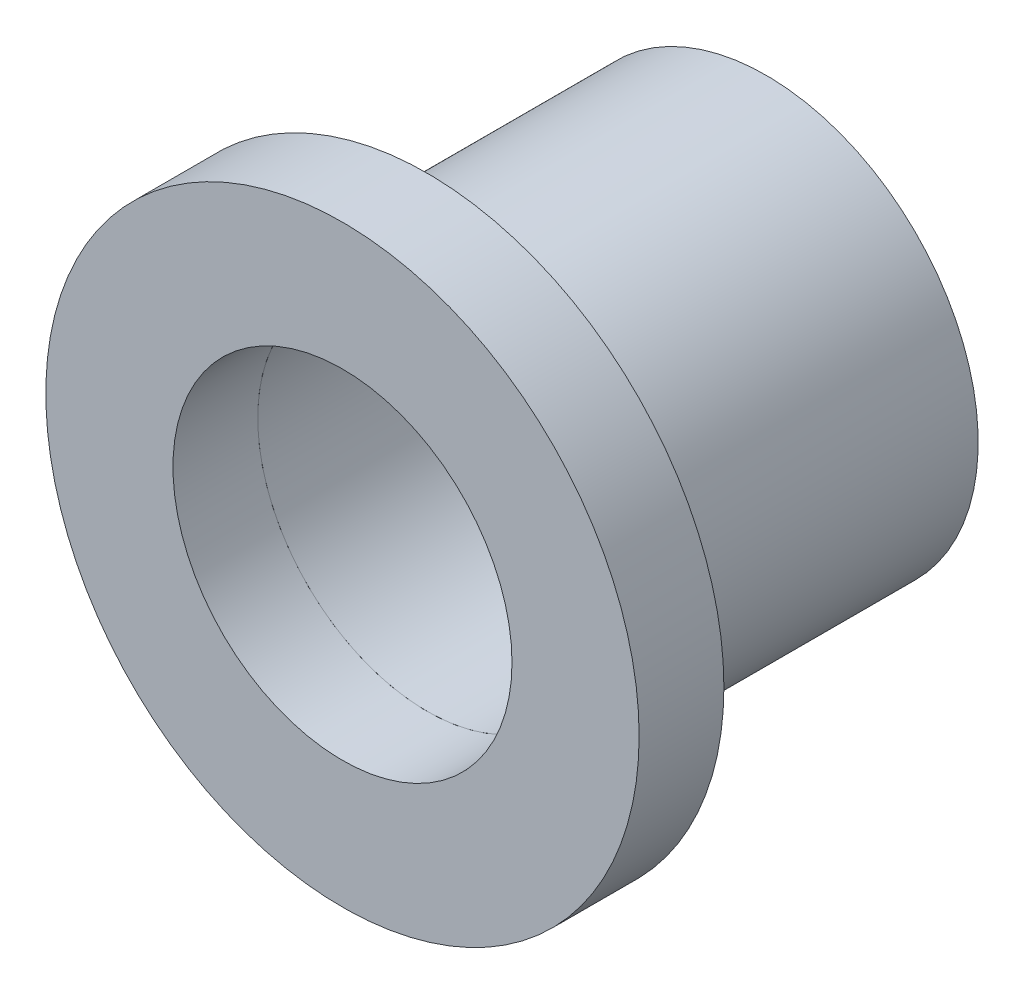
ISO-10303-21;
HEADER;
FILE_DESCRIPTION(('STEP AP214'),'2;1');
FILE_NAME('part.step','',(''),(''),'','','');
FILE_SCHEMA(('AUTOMOTIVE_DESIGN { 1 0 10303 214 1 1 1 1 }'));
ENDSEC;
DATA;
#1=APPLICATION_CONTEXT('core data for automotive mechanical design processes');
#2=APPLICATION_PROTOCOL_DEFINITION('international standard','automotive_design',2000,#1);
#3=PRODUCT_CONTEXT('',#1,'mechanical');
#4=PRODUCT('Part','Part','',(#3));
#5=PRODUCT_RELATED_PRODUCT_CATEGORY('part','',(#4));
#6=PRODUCT_DEFINITION_FORMATION('','',#4);
#7=PRODUCT_DEFINITION_CONTEXT('part definition',#1,'design');
#8=PRODUCT_DEFINITION('design','',#6,#7);
#9=PRODUCT_DEFINITION_SHAPE('','',#8);
#10=(LENGTH_UNIT() NAMED_UNIT(*) SI_UNIT(.MILLI.,.METRE.));
#11=(NAMED_UNIT(*) PLANE_ANGLE_UNIT() SI_UNIT($,.RADIAN.));
#12=(NAMED_UNIT(*) SI_UNIT($,.STERADIAN.) SOLID_ANGLE_UNIT());
#13=UNCERTAINTY_MEASURE_WITH_UNIT(LENGTH_MEASURE(1.E-05),#10,'distance_accuracy_value','');
#14=(GEOMETRIC_REPRESENTATION_CONTEXT(3) GLOBAL_UNCERTAINTY_ASSIGNED_CONTEXT((#13)) GLOBAL_UNIT_ASSIGNED_CONTEXT((#10,
#11,#12)) REPRESENTATION_CONTEXT('',''));
#15=CARTESIAN_POINT('',(0.,0.,0.));
#16=DIRECTION('',(0.,0.,1.));
#17=DIRECTION('',(1.,0.,0.));
#18=AXIS2_PLACEMENT_3D('',#15,#16,#17);
#19=CARTESIAN_POINT('',(0.,0.,-12.7));
#20=DIRECTION('',(0.,0.,-1.));
#21=DIRECTION('',(-1.,0.,0.));
#22=AXIS2_PLACEMENT_3D('',#19,#20,#21);
#23=PLANE('',#22);
#24=CARTESIAN_POINT('',(0.,0.,-12.7));
#25=DIRECTION('',(0.,0.,-1.));
#26=DIRECTION('',(-1.,0.,0.));
#27=AXIS2_PLACEMENT_3D('',#24,#25,#26);
#28=CIRCLE('',#27,7.9375);
#29=CARTESIAN_POINT('',(-7.9375,0.,-12.7));
#30=VERTEX_POINT('',#29);
#31=EDGE_CURVE('E11',#30,#30,#28,.T.);
#32=ORIENTED_EDGE('',*,*,#31,.T.);
#33=EDGE_LOOP('',(#32));
#34=FACE_BOUND('',#33,.T.);
#35=CARTESIAN_POINT('',(0.,0.,-12.7));
#36=DIRECTION('',(0.,0.,-1.));
#37=DIRECTION('',(-1.,0.,0.));
#38=AXIS2_PLACEMENT_3D('',#35,#36,#37);
#39=CIRCLE('',#38,6.35);
#40=CARTESIAN_POINT('',(-6.35,0.,-12.7));
#41=VERTEX_POINT('',#40);
#42=EDGE_CURVE('E51',#41,#41,#39,.T.);
#43=ORIENTED_EDGE('',*,*,#42,.F.);
#44=EDGE_LOOP('',(#43));
#45=FACE_BOUND('',#44,.T.);
#46=ADVANCED_FACE('F40',(#34,#45),#23,.T.);
#47=CARTESIAN_POINT('',(0.,0.,0.));
#48=DIRECTION('',(0.,0.,-1.));
#49=DIRECTION('',(-1.,0.,0.));
#50=AXIS2_PLACEMENT_3D('',#47,#48,#49);
#51=PLANE('',#50);
#52=CARTESIAN_POINT('',(0.,0.,0.));
#53=DIRECTION('',(0.,0.,-1.));
#54=DIRECTION('',(-1.,0.,0.));
#55=AXIS2_PLACEMENT_3D('',#52,#53,#54);
#56=CIRCLE('',#55,7.9375);
#57=CARTESIAN_POINT('',(-7.9375,0.,0.));
#58=VERTEX_POINT('',#57);
#59=EDGE_CURVE('E44',#58,#58,#56,.T.);
#60=ORIENTED_EDGE('',*,*,#59,.F.);
#61=EDGE_LOOP('',(#60));
#62=FACE_BOUND('',#61,.T.);
#63=CARTESIAN_POINT('',(0.,0.,0.));
#64=DIRECTION('',(0.,0.,-1.));
#65=DIRECTION('',(-1.,0.,0.));
#66=AXIS2_PLACEMENT_3D('',#63,#64,#65);
#67=CIRCLE('',#66,6.35);
#68=CARTESIAN_POINT('',(-6.35,0.,0.));
#69=VERTEX_POINT('',#68);
#70=EDGE_CURVE('E53',#69,#69,#67,.T.);
#71=ORIENTED_EDGE('',*,*,#70,.T.);
#72=EDGE_LOOP('',(#71));
#73=FACE_BOUND('',#72,.T.);
#74=ADVANCED_FACE('F63',(#62,#73),#51,.F.);
#75=CARTESIAN_POINT('',(0.,0.,-12.7));
#76=DIRECTION('',(0.,0.,1.));
#77=DIRECTION('',(1.,0.,0.));
#78=AXIS2_PLACEMENT_3D('',#75,#76,#77);
#79=CYLINDRICAL_SURFACE('',#78,7.9375);
#80=ORIENTED_EDGE('',*,*,#31,.F.);
#81=EDGE_LOOP('',(#80));
#82=FACE_BOUND('',#81,.T.);
#83=ORIENTED_EDGE('',*,*,#59,.T.);
#84=EDGE_LOOP('',(#83));
#85=FACE_BOUND('',#84,.T.);
#86=ADVANCED_FACE('F42',(#82,#85),#79,.T.);
#87=CARTESIAN_POINT('',(0.,0.,-12.7));
#88=DIRECTION('',(0.,0.,1.));
#89=DIRECTION('',(1.,0.,0.));
#90=AXIS2_PLACEMENT_3D('',#87,#88,#89);
#91=CYLINDRICAL_SURFACE('',#90,6.35);
#92=ORIENTED_EDGE('',*,*,#42,.T.);
#93=EDGE_LOOP('',(#92));
#94=FACE_BOUND('',#93,.T.);
#95=ORIENTED_EDGE('',*,*,#70,.F.);
#96=EDGE_LOOP('',(#95));
#97=FACE_BOUND('',#96,.T.);
#98=ADVANCED_FACE('F59',(#94,#97),#91,.F.);
#99=CLOSED_SHELL('',(#46,#74,#86,#98));
#100=MANIFOLD_SOLID_BREP('B2',#99);
#101=CARTESIAN_POINT('',(0.,0.,3.175));
#102=DIRECTION('',(0.,0.,1.));
#103=DIRECTION('',(1.,0.,0.));
#104=AXIS2_PLACEMENT_3D('',#101,#102,#103);
#105=PLANE('',#104);
#106=CARTESIAN_POINT('',(0.,0.,3.175));
#107=DIRECTION('',(0.,0.,1.));
#108=DIRECTION('',(1.,0.,0.));
#109=AXIS2_PLACEMENT_3D('',#106,#107,#108);
#110=CIRCLE('',#109,11.1125);
#111=CARTESIAN_POINT('',(11.1125,0.,3.175));
#112=VERTEX_POINT('',#111);
#113=EDGE_CURVE('E39',#112,#112,#110,.T.);
#114=ORIENTED_EDGE('',*,*,#113,.T.);
#115=EDGE_LOOP('',(#114));
#116=FACE_BOUND('',#115,.T.);
#117=CARTESIAN_POINT('',(0.,0.,3.175));
#118=DIRECTION('',(0.,0.,1.));
#119=DIRECTION('',(1.,0.,0.));
#120=AXIS2_PLACEMENT_3D('',#117,#118,#119);
#121=CIRCLE('',#120,6.35);
#122=CARTESIAN_POINT('',(6.35,0.,3.175));
#123=VERTEX_POINT('',#122);
#124=EDGE_CURVE('E112',#123,#123,#121,.T.);
#125=ORIENTED_EDGE('',*,*,#124,.F.);
#126=EDGE_LOOP('',(#125));
#127=FACE_BOUND('',#126,.T.);
#128=ADVANCED_FACE('F101',(#116,#127),#105,.T.);
#129=CARTESIAN_POINT('',(0.,0.,0.));
#130=DIRECTION('',(0.,0.,1.));
#131=DIRECTION('',(1.,0.,0.));
#132=AXIS2_PLACEMENT_3D('',#129,#130,#131);
#133=PLANE('',#132);
#134=CARTESIAN_POINT('',(0.,0.,0.));
#135=DIRECTION('',(0.,0.,1.));
#136=DIRECTION('',(1.,0.,0.));
#137=AXIS2_PLACEMENT_3D('',#134,#135,#136);
#138=CIRCLE('',#137,11.1125);
#139=CARTESIAN_POINT('',(11.1125,0.,0.));
#140=VERTEX_POINT('',#139);
#141=EDGE_CURVE('E105',#140,#140,#138,.T.);
#142=ORIENTED_EDGE('',*,*,#141,.F.);
#143=EDGE_LOOP('',(#142));
#144=FACE_BOUND('',#143,.T.);
#145=CARTESIAN_POINT('',(0.,0.,0.));
#146=DIRECTION('',(0.,0.,1.));
#147=DIRECTION('',(1.,0.,0.));
#148=AXIS2_PLACEMENT_3D('',#145,#146,#147);
#149=CIRCLE('',#148,6.35);
#150=CARTESIAN_POINT('',(6.35,0.,0.));
#151=VERTEX_POINT('',#150);
#152=EDGE_CURVE('E114',#151,#151,#149,.T.);
#153=ORIENTED_EDGE('',*,*,#152,.T.);
#154=EDGE_LOOP('',(#153));
#155=FACE_BOUND('',#154,.T.);
#156=ADVANCED_FACE('F124',(#144,#155),#133,.F.);
#157=CARTESIAN_POINT('',(0.,0.,3.175));
#158=DIRECTION('',(0.,0.,-1.));
#159=DIRECTION('',(-1.,0.,0.));
#160=AXIS2_PLACEMENT_3D('',#157,#158,#159);
#161=CYLINDRICAL_SURFACE('',#160,11.1125);
#162=ORIENTED_EDGE('',*,*,#113,.F.);
#163=EDGE_LOOP('',(#162));
#164=FACE_BOUND('',#163,.T.);
#165=ORIENTED_EDGE('',*,*,#141,.T.);
#166=EDGE_LOOP('',(#165));
#167=FACE_BOUND('',#166,.T.);
#168=ADVANCED_FACE('F103',(#164,#167),#161,.T.);
#169=CARTESIAN_POINT('',(0.,0.,3.175));
#170=DIRECTION('',(0.,0.,-1.));
#171=DIRECTION('',(-1.,0.,0.));
#172=AXIS2_PLACEMENT_3D('',#169,#170,#171);
#173=CYLINDRICAL_SURFACE('',#172,6.35);
#174=ORIENTED_EDGE('',*,*,#124,.T.);
#175=EDGE_LOOP('',(#174));
#176=FACE_BOUND('',#175,.T.);
#177=ORIENTED_EDGE('',*,*,#152,.F.);
#178=EDGE_LOOP('',(#177));
#179=FACE_BOUND('',#178,.T.);
#180=ADVANCED_FACE('F120',(#176,#179),#173,.F.);
#181=CLOSED_SHELL('',(#128,#156,#168,#180));
#182=MANIFOLD_SOLID_BREP('B6',#181);
#183=ADVANCED_BREP_SHAPE_REPRESENTATION('',(#18,#100,#182),#14);
#184=SHAPE_DEFINITION_REPRESENTATION(#9,#183);
ENDSEC;
END-ISO-10303-21;
